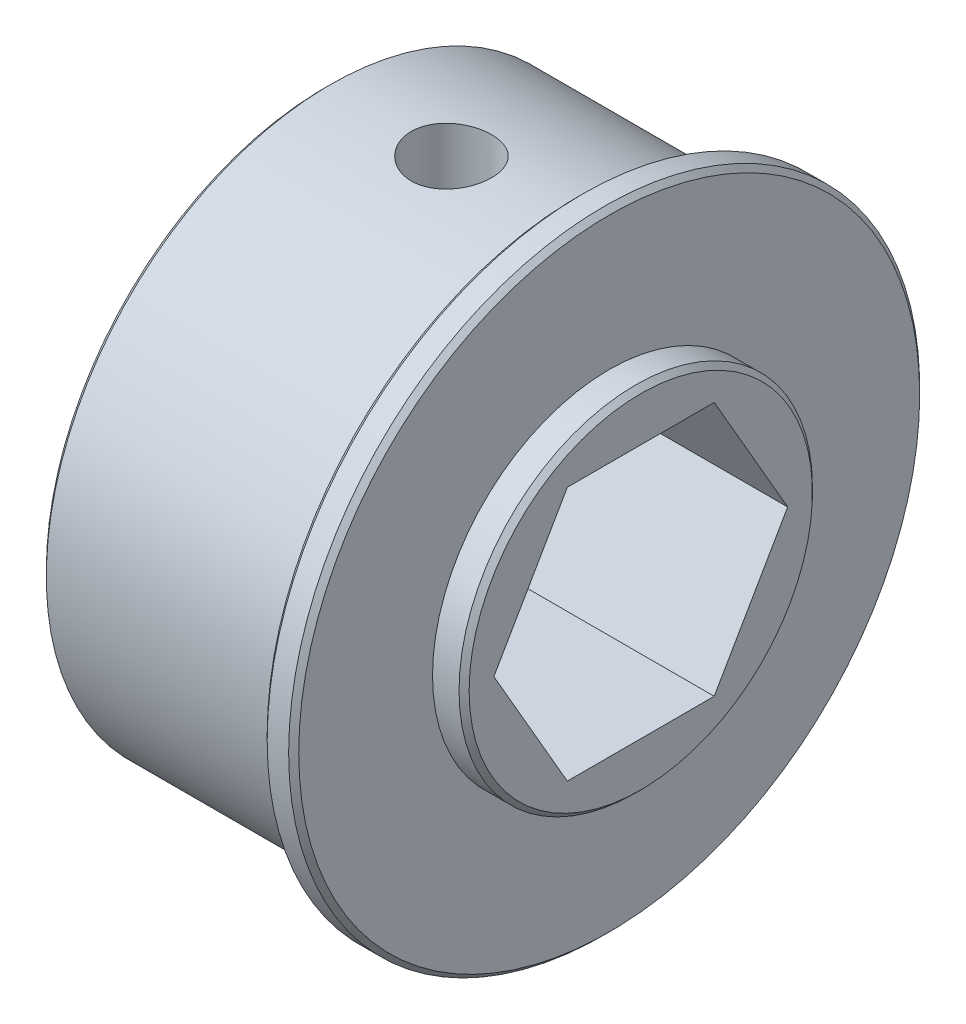
ISO-10303-21;
HEADER;
FILE_DESCRIPTION(('STEP AP214'),'2;1');
FILE_NAME('part.step','',(''),(''),'','','');
FILE_SCHEMA(('AUTOMOTIVE_DESIGN { 1 0 10303 214 1 1 1 1 }'));
ENDSEC;
DATA;
#1=APPLICATION_CONTEXT('core data for automotive mechanical design processes');
#2=APPLICATION_PROTOCOL_DEFINITION('international standard','automotive_design',2000,#1);
#3=PRODUCT_CONTEXT('',#1,'mechanical');
#4=PRODUCT('Part','Part','',(#3));
#5=PRODUCT_RELATED_PRODUCT_CATEGORY('part','',(#4));
#6=PRODUCT_DEFINITION_FORMATION('','',#4);
#7=PRODUCT_DEFINITION_CONTEXT('part definition',#1,'design');
#8=PRODUCT_DEFINITION('design','',#6,#7);
#9=PRODUCT_DEFINITION_SHAPE('','',#8);
#10=(LENGTH_UNIT() NAMED_UNIT(*) SI_UNIT(.MILLI.,.METRE.));
#11=(NAMED_UNIT(*) PLANE_ANGLE_UNIT() SI_UNIT($,.RADIAN.));
#12=(NAMED_UNIT(*) SI_UNIT($,.STERADIAN.) SOLID_ANGLE_UNIT());
#13=UNCERTAINTY_MEASURE_WITH_UNIT(LENGTH_MEASURE(1.E-05),#10,'distance_accuracy_value','');
#14=(GEOMETRIC_REPRESENTATION_CONTEXT(3) GLOBAL_UNCERTAINTY_ASSIGNED_CONTEXT((#13)) GLOBAL_UNIT_ASSIGNED_CONTEXT((#10,
#11,#12)) REPRESENTATION_CONTEXT('',''));
#15=CARTESIAN_POINT('',(0.,0.,0.));
#16=DIRECTION('',(0.,0.,1.));
#17=DIRECTION('',(1.,0.,0.));
#18=AXIS2_PLACEMENT_3D('',#15,#16,#17);
#19=CARTESIAN_POINT('',(3.175,0.,0.));
#20=DIRECTION('',(-1.,0.,0.));
#21=DIRECTION('',(0.,0.,1.));
#22=AXIS2_PLACEMENT_3D('',#19,#20,#21);
#23=CYLINDRICAL_SURFACE('',#22,8.89);
#24=CARTESIAN_POINT('',(1.5875,0.,0.));
#25=DIRECTION('',(-1.,0.,0.));
#26=DIRECTION('',(0.,0.,1.));
#27=AXIS2_PLACEMENT_3D('',#24,#25,#26);
#28=CIRCLE('',#27,8.89);
#29=CARTESIAN_POINT('',(1.5875,0.,8.89));
#30=VERTEX_POINT('',#29);
#31=EDGE_CURVE('E19',#30,#30,#28,.T.);
#32=ORIENTED_EDGE('',*,*,#31,.F.);
#33=EDGE_LOOP('',(#32));
#34=FACE_BOUND('',#33,.T.);
#35=CARTESIAN_POINT('',(2.92100000000001,0.,0.));
#36=DIRECTION('',(-1.,0.,0.));
#37=DIRECTION('',(0.,0.,1.));
#38=AXIS2_PLACEMENT_3D('',#35,#36,#37);
#39=CIRCLE('',#38,8.89);
#40=CARTESIAN_POINT('',(2.92100000000001,0.,8.89));
#41=VERTEX_POINT('',#40);
#42=EDGE_CURVE('E92',#41,#41,#39,.F.);
#43=ORIENTED_EDGE('',*,*,#42,.F.);
#44=EDGE_LOOP('',(#43));
#45=FACE_BOUND('',#44,.T.);
#46=ADVANCED_FACE('F16',(#34,#45),#23,.T.);
#47=CARTESIAN_POINT('',(2.92100000000001,0.,0.));
#48=DIRECTION('',(-1.,0.,0.));
#49=DIRECTION('',(0.,0.,1.));
#50=AXIS2_PLACEMENT_3D('',#47,#48,#49);
#51=CONICAL_SURFACE('',#50,8.89,0.785398163397449);
#52=ORIENTED_EDGE('',*,*,#42,.T.);
#53=EDGE_LOOP('',(#52));
#54=FACE_BOUND('',#53,.T.);
#55=CARTESIAN_POINT('',(3.175,0.,0.));
#56=DIRECTION('',(-1.,0.,0.));
#57=DIRECTION('',(0.,0.,1.));
#58=AXIS2_PLACEMENT_3D('',#55,#56,#57);
#59=CIRCLE('',#58,8.636);
#60=CARTESIAN_POINT('',(3.175,0.,8.636));
#61=VERTEX_POINT('',#60);
#62=EDGE_CURVE('E179',#61,#61,#59,.F.);
#63=ORIENTED_EDGE('',*,*,#62,.F.);
#64=EDGE_LOOP('',(#63));
#65=FACE_BOUND('',#64,.T.);
#66=ADVANCED_FACE('F166',(#54,#65),#51,.T.);
#67=CARTESIAN_POINT('',(1.5875,0.,0.));
#68=DIRECTION('',(1.,0.,0.));
#69=DIRECTION('',(0.,0.,-1.));
#70=AXIS2_PLACEMENT_3D('',#67,#68,#69);
#71=PLANE('',#70);
#72=ORIENTED_EDGE('',*,*,#31,.T.);
#73=EDGE_LOOP('',(#72));
#74=FACE_BOUND('',#73,.T.);
#75=CARTESIAN_POINT('',(1.5875,0.,0.));
#76=DIRECTION('',(-1.,0.,0.));
#77=DIRECTION('',(0.,0.,1.));
#78=AXIS2_PLACEMENT_3D('',#75,#76,#77);
#79=CIRCLE('',#78,15.621);
#80=CARTESIAN_POINT('',(1.5875,0.,15.621));
#81=VERTEX_POINT('',#80);
#82=EDGE_CURVE('E69',#81,#81,#79,.T.);
#83=ORIENTED_EDGE('',*,*,#82,.F.);
#84=EDGE_LOOP('',(#83));
#85=FACE_BOUND('',#84,.T.);
#86=ADVANCED_FACE('F164',(#74,#85),#71,.T.);
#87=CARTESIAN_POINT('',(3.175,0.,0.));
#88=DIRECTION('',(1.,0.,0.));
#89=DIRECTION('',(0.,0.,-1.));
#90=AXIS2_PLACEMENT_3D('',#87,#88,#89);
#91=PLANE('',#90);
#92=DIRECTION('',(0.,0.,1.));
#93=VECTOR('',#92,1.);
#94=CARTESIAN_POINT('',(3.175,6.4008,-3.69550360302896));
#95=LINE('',#94,#93);
#96=CARTESIAN_POINT('',(3.175,6.4008,3.69550360302896));
#97=VERTEX_POINT('',#96);
#98=CARTESIAN_POINT('',(3.175,6.4008,-3.69550360302896));
#99=VERTEX_POINT('',#98);
#100=EDGE_CURVE('E85',#97,#99,#95,.F.);
#101=ORIENTED_EDGE('',*,*,#100,.T.);
#102=DIRECTION('',(0.,0.866025403784439,0.5));
#103=VECTOR('',#102,1.);
#104=CARTESIAN_POINT('',(3.175,0.,-7.39100720605791));
#105=LINE('',#104,#103);
#106=CARTESIAN_POINT('',(3.175,0.,-7.39100720605791));
#107=VERTEX_POINT('',#106);
#108=EDGE_CURVE('E213',#99,#107,#105,.F.);
#109=ORIENTED_EDGE('',*,*,#108,.T.);
#110=DIRECTION('',(0.,0.866025403784439,-0.5));
#111=VECTOR('',#110,1.);
#112=CARTESIAN_POINT('',(3.175,-6.4008,-3.69550360302896));
#113=LINE('',#112,#111);
#114=CARTESIAN_POINT('',(3.175,-6.4008,-3.69550360302896));
#115=VERTEX_POINT('',#114);
#116=EDGE_CURVE('E208',#107,#115,#113,.F.);
#117=ORIENTED_EDGE('',*,*,#116,.T.);
#118=DIRECTION('',(0.,0.,-1.));
#119=VECTOR('',#118,1.);
#120=CARTESIAN_POINT('',(3.175,-6.4008,3.69550360302896));
#121=LINE('',#120,#119);
#122=CARTESIAN_POINT('',(3.175,-6.4008,3.69550360302896));
#123=VERTEX_POINT('',#122);
#124=EDGE_CURVE('E64',#115,#123,#121,.F.);
#125=ORIENTED_EDGE('',*,*,#124,.T.);
#126=DIRECTION('',(0.,-0.866025403784439,-0.5));
#127=VECTOR('',#126,1.);
#128=CARTESIAN_POINT('',(3.175,0.,7.39100720605791));
#129=LINE('',#128,#127);
#130=CARTESIAN_POINT('',(3.175,0.,7.39100720605791));
#131=VERTEX_POINT('',#130);
#132=EDGE_CURVE('E56',#123,#131,#129,.F.);
#133=ORIENTED_EDGE('',*,*,#132,.T.);
#134=DIRECTION('',(0.,-0.866025403784439,0.5));
#135=VECTOR('',#134,1.);
#136=CARTESIAN_POINT('',(3.175,6.4008,3.69550360302896));
#137=LINE('',#136,#135);
#138=EDGE_CURVE('E61',#131,#97,#137,.F.);
#139=ORIENTED_EDGE('',*,*,#138,.T.);
#140=EDGE_LOOP('',(#101,#109,#117,#125,#133,#139));
#141=FACE_BOUND('',#140,.T.);
#142=ORIENTED_EDGE('',*,*,#62,.T.);
#143=EDGE_LOOP('',(#142));
#144=FACE_BOUND('',#143,.T.);
#145=ADVANCED_FACE('F58',(#141,#144),#91,.T.);
#146=CARTESIAN_POINT('',(1.3335,0.,0.));
#147=DIRECTION('',(-1.,0.,0.));
#148=DIRECTION('',(0.,0.,1.));
#149=AXIS2_PLACEMENT_3D('',#146,#147,#148);
#150=CONICAL_SURFACE('',#149,15.875,0.785398163397447);
#151=ORIENTED_EDGE('',*,*,#82,.T.);
#152=EDGE_LOOP('',(#151));
#153=FACE_BOUND('',#152,.T.);
#154=CARTESIAN_POINT('',(1.3335,0.,0.));
#155=DIRECTION('',(-1.,0.,0.));
#156=DIRECTION('',(0.,0.,1.));
#157=AXIS2_PLACEMENT_3D('',#154,#155,#156);
#158=CIRCLE('',#157,15.875);
#159=CARTESIAN_POINT('',(1.3335,0.,15.875));
#160=VERTEX_POINT('',#159);
#161=EDGE_CURVE('E89',#160,#160,#158,.T.);
#162=ORIENTED_EDGE('',*,*,#161,.F.);
#163=EDGE_LOOP('',(#162));
#164=FACE_BOUND('',#163,.T.);
#165=ADVANCED_FACE('F158',(#153,#164),#150,.T.);
#166=CARTESIAN_POINT('',(-12.7,0.,7.39100720605791));
#167=DIRECTION('',(0.,-0.5,0.866025403784439));
#168=DIRECTION('',(0.,-0.866025403784439,-0.5));
#169=AXIS2_PLACEMENT_3D('',#166,#167,#168);
#170=PLANE('',#169);
#171=DIRECTION('',(1.,0.,0.));
#172=VECTOR('',#171,1.);
#173=CARTESIAN_POINT('',(-12.7,-6.4008,3.69550360302896));
#174=LINE('',#173,#172);
#175=CARTESIAN_POINT('',(-12.7,-6.4008,3.69550360302896));
#176=VERTEX_POINT('',#175);
#177=EDGE_CURVE('E206',#123,#176,#174,.F.);
#178=ORIENTED_EDGE('',*,*,#177,.T.);
#179=DIRECTION('',(0.,0.866025403784439,0.5));
#180=VECTOR('',#179,1.);
#181=CARTESIAN_POINT('',(-12.7,-6.4008,3.69550360302896));
#182=LINE('',#181,#180);
#183=CARTESIAN_POINT('',(-12.7,0.,7.39100720605791));
#184=VERTEX_POINT('',#183);
#185=EDGE_CURVE('E75',#176,#184,#182,.T.);
#186=ORIENTED_EDGE('',*,*,#185,.T.);
#187=DIRECTION('',(1.,0.,0.));
#188=VECTOR('',#187,1.);
#189=CARTESIAN_POINT('',(-12.7,0.,7.39100720605791));
#190=LINE('',#189,#188);
#191=EDGE_CURVE('E68',#184,#131,#190,.T.);
#192=ORIENTED_EDGE('',*,*,#191,.T.);
#193=ORIENTED_EDGE('',*,*,#132,.F.);
#194=EDGE_LOOP('',(#178,#186,#192,#193));
#195=FACE_BOUND('',#194,.T.);
#196=ADVANCED_FACE('F73',(#195),#170,.F.);
#197=CARTESIAN_POINT('',(-12.7,6.4008,3.69550360302896));
#198=DIRECTION('',(0.,0.5,0.866025403784439));
#199=DIRECTION('',(0.,-0.866025403784439,0.5));
#200=AXIS2_PLACEMENT_3D('',#197,#198,#199);
#201=PLANE('',#200);
#202=ORIENTED_EDGE('',*,*,#191,.F.);
#203=DIRECTION('',(0.,0.866025403784439,-0.5));
#204=VECTOR('',#203,1.);
#205=CARTESIAN_POINT('',(-12.7,0.,7.39100720605791));
#206=LINE('',#205,#204);
#207=CARTESIAN_POINT('',(-12.7,6.4008,3.69550360302896));
#208=VERTEX_POINT('',#207);
#209=EDGE_CURVE('E239',#184,#208,#206,.T.);
#210=ORIENTED_EDGE('',*,*,#209,.T.);
#211=DIRECTION('',(1.,0.,0.));
#212=VECTOR('',#211,1.);
#213=CARTESIAN_POINT('',(-12.7,6.4008,3.69550360302896));
#214=LINE('',#213,#212);
#215=EDGE_CURVE('E82',#208,#97,#214,.T.);
#216=ORIENTED_EDGE('',*,*,#215,.T.);
#217=ORIENTED_EDGE('',*,*,#138,.F.);
#218=EDGE_LOOP('',(#202,#210,#216,#217));
#219=FACE_BOUND('',#218,.T.);
#220=ADVANCED_FACE('F80',(#219),#201,.F.);
#221=CARTESIAN_POINT('',(-12.7,6.4008,-3.69550360302896));
#222=DIRECTION('',(0.,1.,0.));
#223=DIRECTION('',(0.,0.,1.));
#224=AXIS2_PLACEMENT_3D('',#221,#222,#223);
#225=PLANE('',#224);
#226=ORIENTED_EDGE('',*,*,#215,.F.);
#227=DIRECTION('',(0.,0.,-1.));
#228=VECTOR('',#227,1.);
#229=CARTESIAN_POINT('',(-12.7,6.4008,0.));
#230=LINE('',#229,#228);
#231=CARTESIAN_POINT('',(-12.7,6.4008,-3.69550360302896));
#232=VERTEX_POINT('',#231);
#233=EDGE_CURVE('E222',#208,#232,#230,.T.);
#234=ORIENTED_EDGE('',*,*,#233,.T.);
#235=DIRECTION('',(1.,0.,0.));
#236=VECTOR('',#235,1.);
#237=CARTESIAN_POINT('',(-12.7,6.4008,-3.69550360302896));
#238=LINE('',#237,#236);
#239=EDGE_CURVE('E215',#232,#99,#238,.T.);
#240=ORIENTED_EDGE('',*,*,#239,.T.);
#241=ORIENTED_EDGE('',*,*,#100,.F.);
#242=EDGE_LOOP('',(#226,#234,#240,#241));
#243=FACE_BOUND('',#242,.T.);
#244=ADVANCED_FACE('F149',(#243),#225,.F.);
#245=CARTESIAN_POINT('',(-12.7,0.,-7.39100720605791));
#246=DIRECTION('',(0.,0.5,-0.866025403784439));
#247=DIRECTION('',(0.,0.866025403784439,0.5));
#248=AXIS2_PLACEMENT_3D('',#245,#246,#247);
#249=PLANE('',#248);
#250=ORIENTED_EDGE('',*,*,#239,.F.);
#251=DIRECTION('',(0.,-0.866025403784438,-0.5));
#252=VECTOR('',#251,1.);
#253=CARTESIAN_POINT('',(-12.7,6.4008,-3.69550360302896));
#254=LINE('',#253,#252);
#255=CARTESIAN_POINT('',(-12.7,0.,-7.39100720605791));
#256=VERTEX_POINT('',#255);
#257=EDGE_CURVE('E227',#232,#256,#254,.T.);
#258=ORIENTED_EDGE('',*,*,#257,.T.);
#259=DIRECTION('',(1.,0.,0.));
#260=VECTOR('',#259,1.);
#261=CARTESIAN_POINT('',(-12.7,0.,-7.39100720605791));
#262=LINE('',#261,#260);
#263=EDGE_CURVE('E210',#256,#107,#262,.T.);
#264=ORIENTED_EDGE('',*,*,#263,.T.);
#265=ORIENTED_EDGE('',*,*,#108,.F.);
#266=EDGE_LOOP('',(#250,#258,#264,#265));
#267=FACE_BOUND('',#266,.T.);
#268=ADVANCED_FACE('F145',(#267),#249,.F.);
#269=CARTESIAN_POINT('',(-12.7,-6.4008,-3.69550360302896));
#270=DIRECTION('',(0.,-0.5,-0.866025403784439));
#271=DIRECTION('',(0.,0.866025403784439,-0.5));
#272=AXIS2_PLACEMENT_3D('',#269,#270,#271);
#273=PLANE('',#272);
#274=ORIENTED_EDGE('',*,*,#263,.F.);
#275=DIRECTION('',(0.,-0.866025403784439,0.5));
#276=VECTOR('',#275,1.);
#277=CARTESIAN_POINT('',(-12.7,0.,-7.39100720605791));
#278=LINE('',#277,#276);
#279=CARTESIAN_POINT('',(-12.7,-6.4008,-3.69550360302896));
#280=VERTEX_POINT('',#279);
#281=EDGE_CURVE('E230',#256,#280,#278,.T.);
#282=ORIENTED_EDGE('',*,*,#281,.T.);
#283=DIRECTION('',(1.,0.,0.));
#284=VECTOR('',#283,1.);
#285=CARTESIAN_POINT('',(-12.7,-6.4008,-3.69550360302896));
#286=LINE('',#285,#284);
#287=EDGE_CURVE('E203',#280,#115,#286,.T.);
#288=ORIENTED_EDGE('',*,*,#287,.T.);
#289=ORIENTED_EDGE('',*,*,#116,.F.);
#290=EDGE_LOOP('',(#274,#282,#288,#289));
#291=FACE_BOUND('',#290,.T.);
#292=ADVANCED_FACE('F141',(#291),#273,.F.);
#293=CARTESIAN_POINT('',(-12.7,-6.4008,3.69550360302896));
#294=DIRECTION('',(0.,-1.,0.));
#295=DIRECTION('',(0.,0.,-1.));
#296=AXIS2_PLACEMENT_3D('',#293,#294,#295);
#297=PLANE('',#296);
#298=ORIENTED_EDGE('',*,*,#287,.F.);
#299=DIRECTION('',(0.,0.,-1.));
#300=VECTOR('',#299,1.);
#301=CARTESIAN_POINT('',(-12.7,-6.4008,0.));
#302=LINE('',#301,#300);
#303=EDGE_CURVE('E197',#280,#176,#302,.F.);
#304=ORIENTED_EDGE('',*,*,#303,.T.);
#305=ORIENTED_EDGE('',*,*,#177,.F.);
#306=ORIENTED_EDGE('',*,*,#124,.F.);
#307=EDGE_LOOP('',(#298,#304,#305,#306));
#308=FACE_BOUND('',#307,.T.);
#309=ADVANCED_FACE('F137',(#308),#297,.F.);
#310=CARTESIAN_POINT('',(-6.35,7.93750000002547,0.));
#311=DIRECTION('',(0.,1.,0.));
#312=DIRECTION('',(0.,0.,1.));
#313=AXIS2_PLACEMENT_3D('',#310,#311,#312);
#314=CONICAL_SURFACE('',#313,2.01929999997219,1.02974425867198);
#315=CARTESIAN_POINT('',(-6.35,6.72418215202697,0.));
#316=VERTEX_POINT('',#315);
#317=VERTEX_LOOP('',#316);
#318=FACE_BOUND('',#317,.T.);
#319=CARTESIAN_POINT('',(-6.35,7.9375,0.));
#320=DIRECTION('',(0.,1.,0.));
#321=DIRECTION('',(0.,0.,1.));
#322=AXIS2_PLACEMENT_3D('',#319,#320,#321);
#323=CIRCLE('',#322,2.01929999999999);
#324=CARTESIAN_POINT('',(-6.35,7.9375,2.01929999999999));
#325=VERTEX_POINT('',#324);
#326=EDGE_CURVE('E193',#325,#325,#323,.T.);
#327=ORIENTED_EDGE('',*,*,#326,.T.);
#328=EDGE_LOOP('',(#327));
#329=FACE_BOUND('',#328,.T.);
#330=ADVANCED_FACE('F133',(#318,#329),#314,.F.);
#331=CARTESIAN_POINT('',(1.5875,0.,0.));
#332=DIRECTION('',(-1.,0.,0.));
#333=DIRECTION('',(0.,0.,1.));
#334=AXIS2_PLACEMENT_3D('',#331,#332,#333);
#335=CYLINDRICAL_SURFACE('',#334,15.875);
#336=ORIENTED_EDGE('',*,*,#161,.T.);
#337=EDGE_LOOP('',(#336));
#338=FACE_BOUND('',#337,.T.);
#339=CARTESIAN_POINT('',(0.253999999999997,0.,0.));
#340=DIRECTION('',(1.,0.,0.));
#341=DIRECTION('',(0.,0.,-1.));
#342=AXIS2_PLACEMENT_3D('',#339,#340,#341);
#343=CIRCLE('',#342,15.875);
#344=CARTESIAN_POINT('',(0.253999999999997,0.,-15.875));
#345=VERTEX_POINT('',#344);
#346=EDGE_CURVE('E191',#345,#345,#343,.F.);
#347=ORIENTED_EDGE('',*,*,#346,.F.);
#348=EDGE_LOOP('',(#347));
#349=FACE_BOUND('',#348,.T.);
#350=ADVANCED_FACE('F129',(#338,#349),#335,.T.);
#351=CARTESIAN_POINT('',(-12.7,0.,0.));
#352=DIRECTION('',(1.,0.,0.));
#353=DIRECTION('',(0.,0.,-1.));
#354=AXIS2_PLACEMENT_3D('',#351,#352,#353);
#355=PLANE('',#354);
#356=ORIENTED_EDGE('',*,*,#281,.F.);
#357=ORIENTED_EDGE('',*,*,#257,.F.);
#358=ORIENTED_EDGE('',*,*,#233,.F.);
#359=ORIENTED_EDGE('',*,*,#209,.F.);
#360=ORIENTED_EDGE('',*,*,#185,.F.);
#361=ORIENTED_EDGE('',*,*,#303,.F.);
#362=EDGE_LOOP('',(#356,#357,#358,#359,#360,#361));
#363=FACE_BOUND('',#362,.T.);
#364=CARTESIAN_POINT('',(-12.7,0.,0.));
#365=DIRECTION('',(1.,0.,0.));
#366=DIRECTION('',(0.,0.,-1.));
#367=AXIS2_PLACEMENT_3D('',#364,#365,#366);
#368=CIRCLE('',#367,14.0335);
#369=CARTESIAN_POINT('',(-12.7,0.,-14.0335));
#370=VERTEX_POINT('',#369);
#371=EDGE_CURVE('E116',#370,#370,#368,.T.);
#372=ORIENTED_EDGE('',*,*,#371,.F.);
#373=EDGE_LOOP('',(#372));
#374=FACE_BOUND('',#373,.T.);
#375=ADVANCED_FACE('F124',(#363,#374),#355,.F.);
#376=CARTESIAN_POINT('',(-6.35,14.2875,0.));
#377=DIRECTION('',(0.,1.,0.));
#378=DIRECTION('',(0.,0.,1.));
#379=AXIS2_PLACEMENT_3D('',#376,#377,#378);
#380=CYLINDRICAL_SURFACE('',#379,2.01929999999999);
#381=CARTESIAN_POINT('',(-6.35,14.144082994666,2.0193));
#382=CARTESIAN_POINT('',(-6.46270978043252,14.1440848572454,2.01929494830352));
#383=CARTESIAN_POINT('',(-6.57556587894467,14.1454458805024,2.00982386080186));
#384=CARTESIAN_POINT('',(-6.7982088924763,14.1507430375104,1.97217534297388));
#385=CARTESIAN_POINT('',(-6.90798898861305,14.1546844828974,1.94395932562443));
#386=CARTESIAN_POINT('',(-7.12110470893202,14.1646874218911,1.8696741044343));
#387=CARTESIAN_POINT('',(-7.22444753490229,14.1707464942905,1.82362528341692));
#388=CARTESIAN_POINT('',(-7.42189406589666,14.1842985714464,1.71502478847225));
#389=CARTESIAN_POINT('',(-7.51600143849081,14.1917910034744,1.6524797022028));
#390=CARTESIAN_POINT('',(-7.69303462417489,14.2074272342722,1.51217328150928));
#391=CARTESIAN_POINT('',(-7.77588421230662,14.2155749310997,1.4343161848856));
#392=CARTESIAN_POINT('',(-7.92739205174377,14.2315690971988,1.2657989315602));
#393=CARTESIAN_POINT('',(-7.99604883392367,14.2394155352181,1.17513745108457));
#394=CARTESIAN_POINT('',(-8.11749018201473,14.2539623529557,0.983112202140053));
#395=CARTESIAN_POINT('',(-8.1702063573829,14.2606577427863,0.881704771543285));
#396=CARTESIAN_POINT('',(-8.25783082400248,14.2721058154367,0.671365971979826));
#397=CARTESIAN_POINT('',(-8.29274010812396,14.2768586065682,0.562435022891321));
#398=CARTESIAN_POINT('',(-8.34353419968074,14.2838590054793,0.340911595459713));
#399=CARTESIAN_POINT('',(-8.35954437028774,14.28612311441,0.228348392070306));
#400=CARTESIAN_POINT('',(-8.37247474096552,14.2879475293366,0.00211168387442613));
#401=CARTESIAN_POINT('',(-8.36939585590122,14.2875079649092,-0.111561767461443));
#402=CARTESIAN_POINT('',(-8.34433505905639,14.2839878101692,-0.335936542663665));
#403=CARTESIAN_POINT('',(-8.32248816809108,14.2809260846932,-0.446653285103087));
#404=CARTESIAN_POINT('',(-8.26072280300443,14.272526639762,-0.662834215513373));
#405=CARTESIAN_POINT('',(-8.2208037520711,14.2671888476616,-0.768298235713001));
#406=CARTESIAN_POINT('',(-8.12388550625377,14.2548043308748,-0.971394358653125));
#407=CARTESIAN_POINT('',(-8.06682832552566,14.247751820225,-1.06899842301094));
#408=CARTESIAN_POINT('',(-7.93730058817925,14.2327257552402,-1.25328969037924));
#409=CARTESIAN_POINT('',(-7.86483035509148,14.2247522202398,-1.3399771224765));
#410=CARTESIAN_POINT('',(-7.70579446431181,14.2086932563854,-1.5007629286406));
#411=CARTESIAN_POINT('',(-7.61911362555077,14.200607453654,-1.57474736975061));
#412=CARTESIAN_POINT('',(-7.43445909511833,14.1852981969896,-1.70717057678363));
#413=CARTESIAN_POINT('',(-7.3364802927051,14.1780751363578,-1.76560226741946));
#414=CARTESIAN_POINT('',(-7.13187256086239,14.1653086919635,-1.8652679033142));
#415=CARTESIAN_POINT('',(-7.02523133128519,14.1597677514924,-1.90647686483089));
#416=CARTESIAN_POINT('',(-6.80658871275593,14.1510314499486,-1.97028383212601));
#417=CARTESIAN_POINT('',(-6.69459920164276,14.1478311271646,-1.99292121896487));
#418=CARTESIAN_POINT('',(-6.5431885987086,14.1453494339129,-2.01041173449661));
#419=CARTESIAN_POINT('',(-6.50463245316409,14.1448755243254,-2.0137422538627));
#420=CARTESIAN_POINT('',(-6.42738995630406,14.1442419848102,-2.01818725463624));
#421=CARTESIAN_POINT('',(-6.38870360491022,14.1440823550717,-2.01930173471071));
#422=CARTESIAN_POINT('',(-6.23729021956748,14.1440848572454,-2.01929494830352));
#423=CARTESIAN_POINT('',(-6.12443412105533,14.1454458805024,-2.00982386080186));
#424=CARTESIAN_POINT('',(-5.9017911075237,14.1507430375104,-1.97217534297388));
#425=CARTESIAN_POINT('',(-5.79201101138695,14.1546844828974,-1.94395932562443));
#426=CARTESIAN_POINT('',(-5.57889529106798,14.1646874218911,-1.86967410443429));
#427=CARTESIAN_POINT('',(-5.47555246509771,14.1707464942905,-1.82362528341692));
#428=CARTESIAN_POINT('',(-5.27810593410334,14.1842985714464,-1.71502478847225));
#429=CARTESIAN_POINT('',(-5.18399856150919,14.1917910034744,-1.6524797022028));
#430=CARTESIAN_POINT('',(-5.00696537582511,14.2074272342722,-1.51217328150928));
#431=CARTESIAN_POINT('',(-4.92411578769338,14.2155749310997,-1.43431618488559));
#432=CARTESIAN_POINT('',(-4.77260794825622,14.2315690971988,-1.26579893156019));
#433=CARTESIAN_POINT('',(-4.70395116607633,14.2394155352181,-1.17513745108457));
#434=CARTESIAN_POINT('',(-4.58250981798527,14.2539623529557,-0.983112202140052));
#435=CARTESIAN_POINT('',(-4.5297936426171,14.2606577427863,-0.881704771543284));
#436=CARTESIAN_POINT('',(-4.44216917599753,14.2721058154367,-0.671365971979825));
#437=CARTESIAN_POINT('',(-4.40725989187604,14.2768586065682,-0.56243502289132));
#438=CARTESIAN_POINT('',(-4.35646580031926,14.2838590054793,-0.340911595459711));
#439=CARTESIAN_POINT('',(-4.34045562971226,14.28612311441,-0.228348392070304));
#440=CARTESIAN_POINT('',(-4.32752525903448,14.2879475293366,-0.00211168387442533));
#441=CARTESIAN_POINT('',(-4.33060414409878,14.2875079649092,0.111561767461444));
#442=CARTESIAN_POINT('',(-4.35566494094361,14.2839878101692,0.335936542663666));
#443=CARTESIAN_POINT('',(-4.37751183190892,14.2809260846932,0.446653285103088));
#444=CARTESIAN_POINT('',(-4.43927719699557,14.272526639762,0.662834215513373));
#445=CARTESIAN_POINT('',(-4.4791962479289,14.2671888476616,0.768298235713001));
#446=CARTESIAN_POINT('',(-4.57611449374623,14.2548043308748,0.971394358653126));
#447=CARTESIAN_POINT('',(-4.63317167447434,14.247751820225,1.06899842301094));
#448=CARTESIAN_POINT('',(-4.76269941182074,14.2327257552402,1.25328969037924));
#449=CARTESIAN_POINT('',(-4.83516964490852,14.2247522202398,1.3399771224765));
#450=CARTESIAN_POINT('',(-4.99420553568819,14.2086932563854,1.5007629286406));
#451=CARTESIAN_POINT('',(-5.08088637444923,14.200607453654,1.57474736975061));
#452=CARTESIAN_POINT('',(-5.26554090488167,14.1852981969896,1.70717057678363));
#453=CARTESIAN_POINT('',(-5.3635197072949,14.1780751363578,1.76560226741946));
#454=CARTESIAN_POINT('',(-5.56812743913761,14.1653086919635,1.8652679033142));
#455=CARTESIAN_POINT('',(-5.67476866871481,14.1597677514924,1.90647686483089));
#456=CARTESIAN_POINT('',(-5.89341128724407,14.1510314499486,1.97028383212602));
#457=CARTESIAN_POINT('',(-6.00540079835724,14.1478311271646,1.99292121896487));
#458=CARTESIAN_POINT('',(-6.1568114012914,14.1453494339129,2.01041173449661));
#459=CARTESIAN_POINT('',(-6.19536754683591,14.1448755243254,2.0137422538627));
#460=CARTESIAN_POINT('',(-6.27261004369594,14.1442419848102,2.01818725463624));
#461=CARTESIAN_POINT('',(-6.31129639508978,14.1440823550717,2.01930173471072));
#462=CARTESIAN_POINT('',(-6.35,14.144082994666,2.0193));
#463=B_SPLINE_CURVE_WITH_KNOTS('',3,(#381,#382,#383,#384,#385,#386,#387,#388,#389,#390,#391,
#392,#393,#394,#395,#396,#397,#398,#399,#400,#401,#402,#403,#404,#405,#406,#407,#408,#409,#410,
#411,#412,#413,#414,#415,#416,#417,#418,#419,#420,#421,#422,#423,#424,#425,#426,#427,#428,#429,
#430,#431,#432,#433,#434,#435,#436,#437,#438,#439,#440,#441,#442,#443,#444,#445,#446,#447,#448,
#449,#450,#451,#452,#453,#454,#455,#456,#457,#458,#459,#460,#461,#462),.UNSPECIFIED.,.T.,.F.,(4,
2,2,2,2,2,2,2,2,2,2,2,2,2,2,2,2,2,2,2,2,2,2,2,2,2,2,2,2,2,2,2,2,2,2,2,2,2,2,2,4),(0.,
0.33798172540506,0.676661361564413,1.01495502540221,1.35311379825344,1.69345884511455,
2.03383910414603,2.37565963920306,2.71746111307282,3.05698234773837,3.39648731058473,
3.73357006716555,4.07066358322854,4.40891073452933,4.74715078649165,5.08828181598834,
5.42956776925378,5.7713470967602,6.11239979348322,6.22845984832776,6.34451997298379,
6.68250169838885,7.0211813345482,7.359474998386,7.69763377123723,8.03797881809834,
8.37835907712982,8.72017961218684,9.0619810860566,9.40150232072215,9.74100728356852,
10.0780900401493,10.4151835562123,10.7534307075131,11.0916707594754,11.4328017889721,
11.7740877422376,12.115867069744,12.456919766467,12.5729798213116,12.6890399459676),.UNSPECIFIED.);
#464=CARTESIAN_POINT('',(-6.35,14.144082994666,2.0193));
#465=VERTEX_POINT('',#464);
#466=EDGE_CURVE('E109',#465,#465,#463,.T.);
#467=ORIENTED_EDGE('',*,*,#466,.F.);
#468=EDGE_LOOP('',(#467));
#469=FACE_BOUND('',#468,.T.);
#470=ORIENTED_EDGE('',*,*,#326,.F.);
#471=EDGE_LOOP('',(#470));
#472=FACE_BOUND('',#471,.T.);
#473=ADVANCED_FACE('F118',(#469,#472),#380,.F.);
#474=CARTESIAN_POINT('',(0.253999999999997,0.,0.));
#475=DIRECTION('',(1.,0.,0.));
#476=DIRECTION('',(0.,0.,-1.));
#477=AXIS2_PLACEMENT_3D('',#474,#475,#476);
#478=CONICAL_SURFACE('',#477,15.875,0.785398163397462);
#479=CARTESIAN_POINT('',(0.,0.,0.));
#480=DIRECTION('',(1.,0.,0.));
#481=DIRECTION('',(0.,0.,-1.));
#482=AXIS2_PLACEMENT_3D('',#479,#480,#481);
#483=CIRCLE('',#482,15.621);
#484=CARTESIAN_POINT('',(0.,0.,-15.621));
#485=VERTEX_POINT('',#484);
#486=EDGE_CURVE('E115',#485,#485,#483,.T.);
#487=ORIENTED_EDGE('',*,*,#486,.T.);
#488=EDGE_LOOP('',(#487));
#489=FACE_BOUND('',#488,.T.);
#490=ORIENTED_EDGE('',*,*,#346,.T.);
#491=EDGE_LOOP('',(#490));
#492=FACE_BOUND('',#491,.T.);
#493=ADVANCED_FACE('F123',(#489,#492),#478,.T.);
#494=CARTESIAN_POINT('',(-6.35,-7.93750000002547,0.));
#495=DIRECTION('',(0.,-1.,0.));
#496=DIRECTION('',(0.,0.,-1.));
#497=AXIS2_PLACEMENT_3D('',#494,#495,#496);
#498=CONICAL_SURFACE('',#497,2.01929999997219,1.02974425867198);
#499=CARTESIAN_POINT('',(-6.35,-6.72418215202697,0.));
#500=VERTEX_POINT('',#499);
#501=VERTEX_LOOP('',#500);
#502=FACE_BOUND('',#501,.T.);
#503=CARTESIAN_POINT('',(-6.35,-7.9375,0.));
#504=DIRECTION('',(0.,-1.,0.));
#505=DIRECTION('',(0.,0.,-1.));
#506=AXIS2_PLACEMENT_3D('',#503,#504,#505);
#507=CIRCLE('',#506,2.01929999999999);
#508=CARTESIAN_POINT('',(-6.35,-7.9375,-2.01929999999999));
#509=VERTEX_POINT('',#508);
#510=EDGE_CURVE('E246',#509,#509,#507,.T.);
#511=ORIENTED_EDGE('',*,*,#510,.T.);
#512=EDGE_LOOP('',(#511));
#513=FACE_BOUND('',#512,.T.);
#514=ADVANCED_FACE('F265',(#502,#513),#498,.F.);
#515=CARTESIAN_POINT('',(-12.446,0.,0.));
#516=DIRECTION('',(1.,0.,0.));
#517=DIRECTION('',(0.,0.,-1.));
#518=AXIS2_PLACEMENT_3D('',#515,#516,#517);
#519=CONICAL_SURFACE('',#518,14.2875,0.785398163397455);
#520=ORIENTED_EDGE('',*,*,#371,.T.);
#521=EDGE_LOOP('',(#520));
#522=FACE_BOUND('',#521,.T.);
#523=CARTESIAN_POINT('',(-12.446,0.,0.));
#524=DIRECTION('',(1.,0.,0.));
#525=DIRECTION('',(0.,0.,-1.));
#526=AXIS2_PLACEMENT_3D('',#523,#524,#525);
#527=CIRCLE('',#526,14.2875);
#528=CARTESIAN_POINT('',(-12.446,0.,-14.2875));
#529=VERTEX_POINT('',#528);
#530=EDGE_CURVE('E249',#529,#529,#527,.T.);
#531=ORIENTED_EDGE('',*,*,#530,.F.);
#532=EDGE_LOOP('',(#531));
#533=FACE_BOUND('',#532,.T.);
#534=ADVANCED_FACE('F260',(#522,#533),#519,.T.);
#535=CARTESIAN_POINT('',(0.,0.,0.));
#536=DIRECTION('',(1.,0.,0.));
#537=DIRECTION('',(0.,0.,-1.));
#538=AXIS2_PLACEMENT_3D('',#535,#536,#537);
#539=PLANE('',#538);
#540=CARTESIAN_POINT('',(0.,0.,0.));
#541=DIRECTION('',(1.,0.,0.));
#542=DIRECTION('',(0.,0.,-1.));
#543=AXIS2_PLACEMENT_3D('',#540,#541,#542);
#544=CIRCLE('',#543,14.2875);
#545=CARTESIAN_POINT('',(0.,0.,-14.2875));
#546=VERTEX_POINT('',#545);
#547=EDGE_CURVE('E25',#546,#546,#544,.F.);
#548=ORIENTED_EDGE('',*,*,#547,.F.);
#549=EDGE_LOOP('',(#548));
#550=FACE_BOUND('',#549,.T.);
#551=ORIENTED_EDGE('',*,*,#486,.F.);
#552=EDGE_LOOP('',(#551));
#553=FACE_BOUND('',#552,.T.);
#554=ADVANCED_FACE('F257',(#550,#553),#539,.F.);
#555=CARTESIAN_POINT('',(-6.35,-14.2875,0.));
#556=DIRECTION('',(0.,-1.,0.));
#557=DIRECTION('',(0.,0.,-1.));
#558=AXIS2_PLACEMENT_3D('',#555,#556,#557);
#559=CYLINDRICAL_SURFACE('',#558,2.01929999999999);
#560=CARTESIAN_POINT('',(-6.35,-14.144082994666,2.01929999999999));
#561=CARTESIAN_POINT('',(-6.23729021956748,-14.1440848572454,2.01929494830352));
#562=CARTESIAN_POINT('',(-6.12443412105533,-14.1454458805024,2.00982386080186));
#563=CARTESIAN_POINT('',(-5.9017911075237,-14.1507430375104,1.97217534297388));
#564=CARTESIAN_POINT('',(-5.79201101138695,-14.1546844828974,1.94395932562443));
#565=CARTESIAN_POINT('',(-5.57889529106798,-14.1646874218911,1.8696741044343));
#566=CARTESIAN_POINT('',(-5.47555246509771,-14.1707464942905,1.82362528341692));
#567=CARTESIAN_POINT('',(-5.27810593410334,-14.1842985714464,1.71502478847225));
#568=CARTESIAN_POINT('',(-5.18399856150919,-14.1917910034744,1.6524797022028));
#569=CARTESIAN_POINT('',(-5.00696537582511,-14.2074272342722,1.51217328150928));
#570=CARTESIAN_POINT('',(-4.92411578769338,-14.2155749310997,1.43431618488559));
#571=CARTESIAN_POINT('',(-4.77260794825622,-14.2315690971988,1.2657989315602));
#572=CARTESIAN_POINT('',(-4.70395116607633,-14.2394155352181,1.17513745108457));
#573=CARTESIAN_POINT('',(-4.58250981798527,-14.2539623529557,0.983112202140054));
#574=CARTESIAN_POINT('',(-4.5297936426171,-14.2606577427863,0.881704771543286));
#575=CARTESIAN_POINT('',(-4.44216917599753,-14.2721058154367,0.671365971979826));
#576=CARTESIAN_POINT('',(-4.40725989187604,-14.2768586065682,0.562435022891321));
#577=CARTESIAN_POINT('',(-4.35646580031925,-14.2838590054793,0.340911595459713));
#578=CARTESIAN_POINT('',(-4.34045562971226,-14.28612311441,0.228348392070306));
#579=CARTESIAN_POINT('',(-4.32752525903448,-14.2879475293366,0.00211168387442642));
#580=CARTESIAN_POINT('',(-4.33060414409878,-14.2875079649092,-0.111561767461443));
#581=CARTESIAN_POINT('',(-4.35566494094361,-14.2839878101692,-0.335936542663665));
#582=CARTESIAN_POINT('',(-4.37751183190892,-14.2809260846932,-0.446653285103087));
#583=CARTESIAN_POINT('',(-4.43927719699557,-14.272526639762,-0.662834215513372));
#584=CARTESIAN_POINT('',(-4.4791962479289,-14.2671888476616,-0.768298235713));
#585=CARTESIAN_POINT('',(-4.57611449374623,-14.2548043308748,-0.971394358653125));
#586=CARTESIAN_POINT('',(-4.63317167447434,-14.247751820225,-1.06899842301094));
#587=CARTESIAN_POINT('',(-4.76269941182074,-14.2327257552402,-1.25328969037924));
#588=CARTESIAN_POINT('',(-4.83516964490852,-14.2247522202398,-1.3399771224765));
#589=CARTESIAN_POINT('',(-4.99420553568819,-14.2086932563854,-1.5007629286406));
#590=CARTESIAN_POINT('',(-5.08088637444923,-14.200607453654,-1.57474736975061));
#591=CARTESIAN_POINT('',(-5.26554090488167,-14.1852981969896,-1.70717057678363));
#592=CARTESIAN_POINT('',(-5.3635197072949,-14.1780751363578,-1.76560226741946));
#593=CARTESIAN_POINT('',(-5.56812743913761,-14.1653086919635,-1.8652679033142));
#594=CARTESIAN_POINT('',(-5.67476866871481,-14.1597677514924,-1.90647686483089));
#595=CARTESIAN_POINT('',(-5.89341128724408,-14.1510314499486,-1.97028383212601));
#596=CARTESIAN_POINT('',(-6.00540079835724,-14.1478311271646,-1.99292121896487));
#597=CARTESIAN_POINT('',(-6.1568114012914,-14.1453494339129,-2.01041173449661));
#598=CARTESIAN_POINT('',(-6.19536754683591,-14.1448755243254,-2.0137422538627));
#599=CARTESIAN_POINT('',(-6.27261004369594,-14.1442419848102,-2.01818725463624));
#600=CARTESIAN_POINT('',(-6.31129639508978,-14.1440823550717,-2.01930173471071));
#601=CARTESIAN_POINT('',(-6.46270978043252,-14.1440848572454,-2.01929494830352));
#602=CARTESIAN_POINT('',(-6.57556587894467,-14.1454458805024,-2.00982386080186));
#603=CARTESIAN_POINT('',(-6.7982088924763,-14.1507430375104,-1.97217534297388));
#604=CARTESIAN_POINT('',(-6.90798898861305,-14.1546844828974,-1.94395932562443));
#605=CARTESIAN_POINT('',(-7.12110470893202,-14.1646874218911,-1.86967410443429));
#606=CARTESIAN_POINT('',(-7.22444753490229,-14.1707464942905,-1.82362528341692));
#607=CARTESIAN_POINT('',(-7.42189406589666,-14.1842985714464,-1.71502478847225));
#608=CARTESIAN_POINT('',(-7.51600143849081,-14.1917910034744,-1.6524797022028));
#609=CARTESIAN_POINT('',(-7.69303462417489,-14.2074272342722,-1.51217328150928));
#610=CARTESIAN_POINT('',(-7.77588421230662,-14.2155749310997,-1.43431618488559));
#611=CARTESIAN_POINT('',(-7.92739205174377,-14.2315690971988,-1.2657989315602));
#612=CARTESIAN_POINT('',(-7.99604883392367,-14.2394155352181,-1.17513745108457));
#613=CARTESIAN_POINT('',(-8.11749018201473,-14.2539623529557,-0.983112202140051));
#614=CARTESIAN_POINT('',(-8.1702063573829,-14.2606577427863,-0.881704771543283));
#615=CARTESIAN_POINT('',(-8.25783082400248,-14.2721058154367,-0.671365971979823));
#616=CARTESIAN_POINT('',(-8.29274010812396,-14.2768586065682,-0.562435022891319));
#617=CARTESIAN_POINT('',(-8.34353419968074,-14.2838590054793,-0.340911595459711));
#618=CARTESIAN_POINT('',(-8.35954437028774,-14.28612311441,-0.228348392070304));
#619=CARTESIAN_POINT('',(-8.37247474096552,-14.2879475293366,-0.0021116838744243));
#620=CARTESIAN_POINT('',(-8.36939585590122,-14.2875079649092,0.111561767461445));
#621=CARTESIAN_POINT('',(-8.34433505905639,-14.2839878101692,0.335936542663667));
#622=CARTESIAN_POINT('',(-8.32248816809108,-14.2809260846932,0.446653285103088));
#623=CARTESIAN_POINT('',(-8.26072280300443,-14.272526639762,0.662834215513374));
#624=CARTESIAN_POINT('',(-8.2208037520711,-14.2671888476616,0.768298235713002));
#625=CARTESIAN_POINT('',(-8.12388550625377,-14.2548043308748,0.971394358653127));
#626=CARTESIAN_POINT('',(-8.06682832552566,-14.247751820225,1.06899842301094));
#627=CARTESIAN_POINT('',(-7.93730058817925,-14.2327257552402,1.25328969037924));
#628=CARTESIAN_POINT('',(-7.86483035509148,-14.2247522202398,1.3399771224765));
#629=CARTESIAN_POINT('',(-7.70579446431181,-14.2086932563854,1.5007629286406));
#630=CARTESIAN_POINT('',(-7.61911362555077,-14.200607453654,1.57474736975061));
#631=CARTESIAN_POINT('',(-7.43445909511833,-14.1852981969896,1.70717057678363));
#632=CARTESIAN_POINT('',(-7.3364802927051,-14.1780751363578,1.76560226741946));
#633=CARTESIAN_POINT('',(-7.13187256086239,-14.1653086919635,1.8652679033142));
#634=CARTESIAN_POINT('',(-7.02523133128519,-14.1597677514924,1.90647686483089));
#635=CARTESIAN_POINT('',(-6.80658871275592,-14.1510314499486,1.97028383212602));
#636=CARTESIAN_POINT('',(-6.69459920164276,-14.1478311271646,1.99292121896487));
#637=CARTESIAN_POINT('',(-6.5431885987086,-14.1453494339129,2.01041173449661));
#638=CARTESIAN_POINT('',(-6.50463245316409,-14.1448755243254,2.0137422538627));
#639=CARTESIAN_POINT('',(-6.42738995630406,-14.1442419848102,2.01818725463624));
#640=CARTESIAN_POINT('',(-6.38870360491022,-14.1440823550717,2.01930173471071));
#641=CARTESIAN_POINT('',(-6.35,-14.144082994666,2.01929999999999));
#642=B_SPLINE_CURVE_WITH_KNOTS('',3,(#560,#561,#562,#563,#564,#565,#566,#567,#568,#569,#570,
#571,#572,#573,#574,#575,#576,#577,#578,#579,#580,#581,#582,#583,#584,#585,#586,#587,#588,#589,
#590,#591,#592,#593,#594,#595,#596,#597,#598,#599,#600,#601,#602,#603,#604,#605,#606,#607,#608,
#609,#610,#611,#612,#613,#614,#615,#616,#617,#618,#619,#620,#621,#622,#623,#624,#625,#626,#627,
#628,#629,#630,#631,#632,#633,#634,#635,#636,#637,#638,#639,#640,#641),.UNSPECIFIED.,.T.,.F.,(4,
2,2,2,2,2,2,2,2,2,2,2,2,2,2,2,2,2,2,2,2,2,2,2,2,2,2,2,2,2,2,2,2,2,2,2,2,2,2,2,4),(0.,
0.337981725405059,0.676661361564413,1.01495502540221,1.35311379825344,1.69345884511455,
2.03383910414603,2.37565963920306,2.71746111307282,3.05698234773836,3.39648731058473,
3.73357006716555,4.07066358322854,4.40891073452933,4.74715078649165,5.08828181598833,
5.42956776925377,5.77134709676019,6.11239979348322,6.22845984832776,6.34451997298379,
6.68250169838884,7.0211813345482,7.35947499838599,7.69763377123723,8.03797881809834,
8.37835907712982,8.72017961218685,9.0619810860566,9.40150232072215,9.74100728356851,
10.0780900401493,10.4151835562123,10.7534307075131,11.0916707594754,11.4328017889721,
11.7740877422376,12.115867069744,12.456919766467,12.5729798213115,12.6890399459676),.UNSPECIFIED.);
#643=CARTESIAN_POINT('',(-6.35,-14.144082994666,2.01929999999999));
#644=VERTEX_POINT('',#643);
#645=EDGE_CURVE('E9',#644,#644,#642,.T.);
#646=ORIENTED_EDGE('',*,*,#645,.F.);
#647=EDGE_LOOP('',(#646));
#648=FACE_BOUND('',#647,.T.);
#649=ORIENTED_EDGE('',*,*,#510,.F.);
#650=EDGE_LOOP('',(#649));
#651=FACE_BOUND('',#650,.T.);
#652=ADVANCED_FACE('F100',(#648,#651),#559,.F.);
#653=CARTESIAN_POINT('',(-12.7,0.,0.));
#654=DIRECTION('',(1.,0.,0.));
#655=DIRECTION('',(0.,0.,-1.));
#656=AXIS2_PLACEMENT_3D('',#653,#654,#655);
#657=CYLINDRICAL_SURFACE('',#656,14.2875);
#658=ORIENTED_EDGE('',*,*,#530,.T.);
#659=EDGE_LOOP('',(#658));
#660=FACE_BOUND('',#659,.T.);
#661=ORIENTED_EDGE('',*,*,#645,.T.);
#662=EDGE_LOOP('',(#661));
#663=FACE_BOUND('',#662,.T.);
#664=ORIENTED_EDGE('',*,*,#547,.T.);
#665=EDGE_LOOP('',(#664));
#666=FACE_BOUND('',#665,.T.);
#667=ORIENTED_EDGE('',*,*,#466,.T.);
#668=EDGE_LOOP('',(#667));
#669=FACE_BOUND('',#668,.T.);
#670=ADVANCED_FACE('F103',(#660,#663,#666,#669),#657,.T.);
#671=CLOSED_SHELL('',(#46,#66,#86,#145,#165,#196,#220,#244,#268,#292,#309,#330,#350,#375,#473,
#493,#514,#534,#554,#652,#670));
#672=MANIFOLD_SOLID_BREP('B1',#671);
#673=ADVANCED_BREP_SHAPE_REPRESENTATION('',(#18,#672),#14);
#674=SHAPE_DEFINITION_REPRESENTATION(#9,#673);
ENDSEC;
END-ISO-10303-21;
